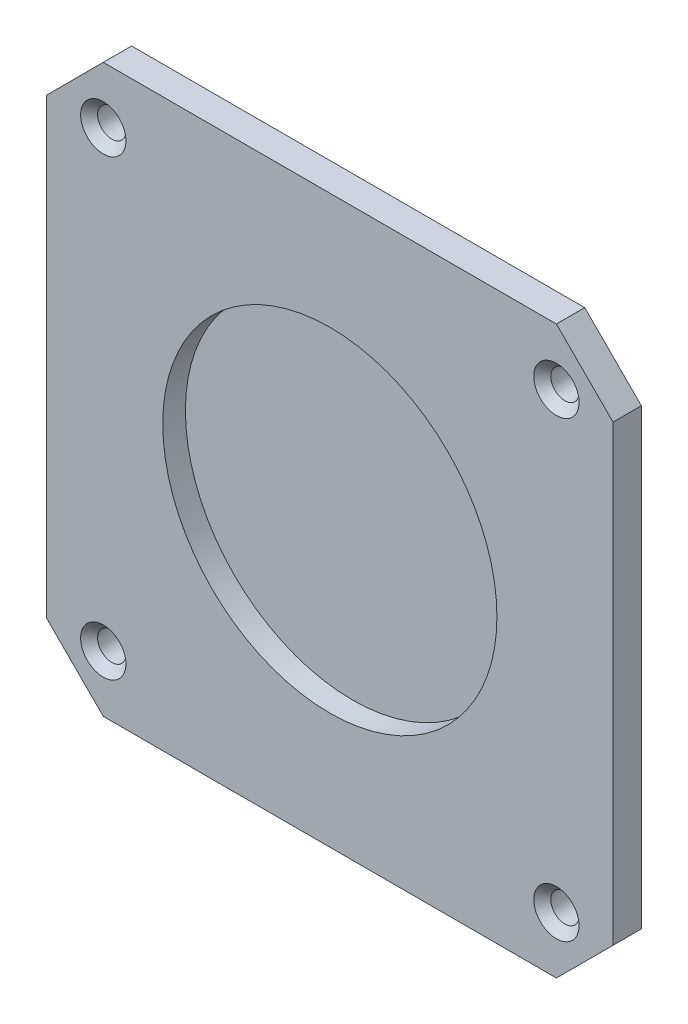
ISO-10303-21;
HEADER;
FILE_DESCRIPTION(('STEP AP214'),'2;1');
FILE_NAME('part.step','',(''),(''),'','','');
FILE_SCHEMA(('AUTOMOTIVE_DESIGN { 1 0 10303 214 1 1 1 1 }'));
ENDSEC;
DATA;
#1=APPLICATION_CONTEXT('core data for automotive mechanical design processes');
#2=APPLICATION_PROTOCOL_DEFINITION('international standard','automotive_design',2000,#1);
#3=PRODUCT_CONTEXT('',#1,'mechanical');
#4=PRODUCT('Part','Part','',(#3));
#5=PRODUCT_RELATED_PRODUCT_CATEGORY('part','',(#4));
#6=PRODUCT_DEFINITION_FORMATION('','',#4);
#7=PRODUCT_DEFINITION_CONTEXT('part definition',#1,'design');
#8=PRODUCT_DEFINITION('design','',#6,#7);
#9=PRODUCT_DEFINITION_SHAPE('','',#8);
#10=(LENGTH_UNIT() NAMED_UNIT(*) SI_UNIT(.MILLI.,.METRE.));
#11=(NAMED_UNIT(*) PLANE_ANGLE_UNIT() SI_UNIT($,.RADIAN.));
#12=(NAMED_UNIT(*) SI_UNIT($,.STERADIAN.) SOLID_ANGLE_UNIT());
#13=UNCERTAINTY_MEASURE_WITH_UNIT(LENGTH_MEASURE(1.E-05),#10,'distance_accuracy_value','');
#14=(GEOMETRIC_REPRESENTATION_CONTEXT(3) GLOBAL_UNCERTAINTY_ASSIGNED_CONTEXT((#13)) GLOBAL_UNIT_ASSIGNED_CONTEXT((#10,
#11,#12)) REPRESENTATION_CONTEXT('',''));
#15=CARTESIAN_POINT('',(0.,0.,0.));
#16=DIRECTION('',(0.,0.,1.));
#17=DIRECTION('',(1.,0.,0.));
#18=AXIS2_PLACEMENT_3D('',#15,#16,#17);
#19=CARTESIAN_POINT('',(0.,10.,5.));
#20=DIRECTION('',(0.707106781186548,0.707106781186547,0.));
#21=DIRECTION('',(-0.707106781186547,0.707106781186548,0.));
#22=AXIS2_PLACEMENT_3D('',#19,#20,#21);
#23=PLANE('',#22);
#24=DIRECTION('',(0.707106781186547,-0.707106781186548,0.));
#25=VECTOR('',#24,1.);
#26=CARTESIAN_POINT('',(0.,10.,0.));
#27=LINE('',#26,#25);
#28=CARTESIAN_POINT('',(0.,10.,0.));
#29=VERTEX_POINT('',#28);
#30=CARTESIAN_POINT('',(10.,0.,0.));
#31=VERTEX_POINT('',#30);
#32=EDGE_CURVE('E143',#29,#31,#27,.T.);
#33=ORIENTED_EDGE('',*,*,#32,.T.);
#34=DIRECTION('',(0.,0.,-1.));
#35=VECTOR('',#34,1.);
#36=CARTESIAN_POINT('',(10.,0.,5.));
#37=LINE('',#36,#35);
#38=CARTESIAN_POINT('',(10.,0.,5.));
#39=VERTEX_POINT('',#38);
#40=EDGE_CURVE('E11',#39,#31,#37,.T.);
#41=ORIENTED_EDGE('',*,*,#40,.F.);
#42=DIRECTION('',(0.707106781186547,-0.707106781186548,0.));
#43=VECTOR('',#42,1.);
#44=CARTESIAN_POINT('',(0.,10.,5.));
#45=LINE('',#44,#43);
#46=CARTESIAN_POINT('',(0.,10.,5.));
#47=VERTEX_POINT('',#46);
#48=EDGE_CURVE('E166',#47,#39,#45,.T.);
#49=ORIENTED_EDGE('',*,*,#48,.F.);
#50=DIRECTION('',(0.,0.,-1.));
#51=VECTOR('',#50,1.);
#52=CARTESIAN_POINT('',(0.,10.,5.));
#53=LINE('',#52,#51);
#54=EDGE_CURVE('E139',#47,#29,#53,.T.);
#55=ORIENTED_EDGE('',*,*,#54,.T.);
#56=EDGE_LOOP('',(#33,#41,#49,#55));
#57=FACE_BOUND('',#56,.T.);
#58=ADVANCED_FACE('F41',(#57),#23,.F.);
#59=CARTESIAN_POINT('',(10.,0.,5.));
#60=DIRECTION('',(0.,1.,0.));
#61=DIRECTION('',(0.,0.,1.));
#62=AXIS2_PLACEMENT_3D('',#59,#60,#61);
#63=PLANE('',#62);
#64=DIRECTION('',(1.,0.,0.));
#65=VECTOR('',#64,1.);
#66=CARTESIAN_POINT('',(10.,0.,0.));
#67=LINE('',#66,#65);
#68=CARTESIAN_POINT('',(90.,0.,0.));
#69=VERTEX_POINT('',#68);
#70=EDGE_CURVE('E147',#31,#69,#67,.T.);
#71=ORIENTED_EDGE('',*,*,#70,.T.);
#72=DIRECTION('',(0.,0.,-1.));
#73=VECTOR('',#72,1.);
#74=CARTESIAN_POINT('',(90.,0.,5.));
#75=LINE('',#74,#73);
#76=CARTESIAN_POINT('',(90.,0.,5.));
#77=VERTEX_POINT('',#76);
#78=EDGE_CURVE('E50',#77,#69,#75,.T.);
#79=ORIENTED_EDGE('',*,*,#78,.F.);
#80=DIRECTION('',(1.,0.,0.));
#81=VECTOR('',#80,1.);
#82=CARTESIAN_POINT('',(10.,0.,5.));
#83=LINE('',#82,#81);
#84=EDGE_CURVE('E101',#39,#77,#83,.T.);
#85=ORIENTED_EDGE('',*,*,#84,.F.);
#86=ORIENTED_EDGE('',*,*,#40,.T.);
#87=EDGE_LOOP('',(#71,#79,#85,#86));
#88=FACE_BOUND('',#87,.T.);
#89=ADVANCED_FACE('F300',(#88),#63,.F.);
#90=CARTESIAN_POINT('',(90.,0.,5.));
#91=DIRECTION('',(-0.707106781186547,0.707106781186548,0.));
#92=DIRECTION('',(-0.707106781186548,-0.707106781186547,0.));
#93=AXIS2_PLACEMENT_3D('',#90,#91,#92);
#94=PLANE('',#93);
#95=DIRECTION('',(0.707106781186548,0.707106781186547,0.));
#96=VECTOR('',#95,1.);
#97=CARTESIAN_POINT('',(90.,0.,0.));
#98=LINE('',#97,#96);
#99=CARTESIAN_POINT('',(100.,10.0000000000001,0.));
#100=VERTEX_POINT('',#99);
#101=EDGE_CURVE('E151',#69,#100,#98,.T.);
#102=ORIENTED_EDGE('',*,*,#101,.T.);
#103=DIRECTION('',(0.,0.,-1.));
#104=VECTOR('',#103,1.);
#105=CARTESIAN_POINT('',(100.,10.0000000000001,5.));
#106=LINE('',#105,#104);
#107=CARTESIAN_POINT('',(100.,10.0000000000001,5.));
#108=VERTEX_POINT('',#107);
#109=EDGE_CURVE('E177',#108,#100,#106,.T.);
#110=ORIENTED_EDGE('',*,*,#109,.F.);
#111=DIRECTION('',(0.707106781186548,0.707106781186547,0.));
#112=VECTOR('',#111,1.);
#113=CARTESIAN_POINT('',(90.,0.,5.));
#114=LINE('',#113,#112);
#115=EDGE_CURVE('E188',#77,#108,#114,.T.);
#116=ORIENTED_EDGE('',*,*,#115,.F.);
#117=ORIENTED_EDGE('',*,*,#78,.T.);
#118=EDGE_LOOP('',(#102,#110,#116,#117));
#119=FACE_BOUND('',#118,.T.);
#120=ADVANCED_FACE('F186',(#119),#94,.F.);
#121=CARTESIAN_POINT('',(100.,10.0000000000001,5.));
#122=DIRECTION('',(-1.,0.,0.));
#123=DIRECTION('',(0.,0.,1.));
#124=AXIS2_PLACEMENT_3D('',#121,#122,#123);
#125=PLANE('',#124);
#126=DIRECTION('',(0.,1.,0.));
#127=VECTOR('',#126,1.);
#128=CARTESIAN_POINT('',(100.,10.0000000000001,0.));
#129=LINE('',#128,#127);
#130=CARTESIAN_POINT('',(100.,90.0000000000001,0.));
#131=VERTEX_POINT('',#130);
#132=EDGE_CURVE('E154',#100,#131,#129,.T.);
#133=ORIENTED_EDGE('',*,*,#132,.T.);
#134=DIRECTION('',(0.,0.,-1.));
#135=VECTOR('',#134,1.);
#136=CARTESIAN_POINT('',(100.,90.0000000000001,5.));
#137=LINE('',#136,#135);
#138=CARTESIAN_POINT('',(100.,90.0000000000001,5.));
#139=VERTEX_POINT('',#138);
#140=EDGE_CURVE('E173',#139,#131,#137,.T.);
#141=ORIENTED_EDGE('',*,*,#140,.F.);
#142=DIRECTION('',(0.,1.,0.));
#143=VECTOR('',#142,1.);
#144=CARTESIAN_POINT('',(100.,10.0000000000001,5.));
#145=LINE('',#144,#143);
#146=EDGE_CURVE('E201',#108,#139,#145,.T.);
#147=ORIENTED_EDGE('',*,*,#146,.F.);
#148=ORIENTED_EDGE('',*,*,#109,.T.);
#149=EDGE_LOOP('',(#133,#141,#147,#148));
#150=FACE_BOUND('',#149,.T.);
#151=ADVANCED_FACE('F196',(#150),#125,.F.);
#152=CARTESIAN_POINT('',(100.,90.0000000000001,5.));
#153=DIRECTION('',(-0.707106781186541,-0.707106781186554,0.));
#154=DIRECTION('',(0.707106781186554,-0.707106781186541,0.));
#155=AXIS2_PLACEMENT_3D('',#152,#153,#154);
#156=PLANE('',#155);
#157=DIRECTION('',(-0.707106781186554,0.707106781186541,0.));
#158=VECTOR('',#157,1.);
#159=CARTESIAN_POINT('',(100.,90.0000000000001,0.));
#160=LINE('',#159,#158);
#161=CARTESIAN_POINT('',(90.,100.,0.));
#162=VERTEX_POINT('',#161);
#163=EDGE_CURVE('E157',#131,#162,#160,.T.);
#164=ORIENTED_EDGE('',*,*,#163,.T.);
#165=DIRECTION('',(0.,0.,-1.));
#166=VECTOR('',#165,1.);
#167=CARTESIAN_POINT('',(90.,100.,5.));
#168=LINE('',#167,#166);
#169=CARTESIAN_POINT('',(90.,100.,5.));
#170=VERTEX_POINT('',#169);
#171=EDGE_CURVE('E131',#170,#162,#168,.T.);
#172=ORIENTED_EDGE('',*,*,#171,.F.);
#173=DIRECTION('',(-0.707106781186554,0.707106781186541,0.));
#174=VECTOR('',#173,1.);
#175=CARTESIAN_POINT('',(100.,90.0000000000001,5.));
#176=LINE('',#175,#174);
#177=EDGE_CURVE('E120',#139,#170,#176,.T.);
#178=ORIENTED_EDGE('',*,*,#177,.F.);
#179=ORIENTED_EDGE('',*,*,#140,.T.);
#180=EDGE_LOOP('',(#164,#172,#178,#179));
#181=FACE_BOUND('',#180,.T.);
#182=ADVANCED_FACE('F199',(#181),#156,.F.);
#183=CARTESIAN_POINT('',(90.,100.,5.));
#184=DIRECTION('',(0.,-1.,0.));
#185=DIRECTION('',(1.,0.,0.));
#186=AXIS2_PLACEMENT_3D('',#183,#184,#185);
#187=PLANE('',#186);
#188=DIRECTION('',(-1.,0.,0.));
#189=VECTOR('',#188,1.);
#190=CARTESIAN_POINT('',(90.,100.,0.));
#191=LINE('',#190,#189);
#192=CARTESIAN_POINT('',(10.,100.,0.));
#193=VERTEX_POINT('',#192);
#194=EDGE_CURVE('E129',#162,#193,#191,.T.);
#195=ORIENTED_EDGE('',*,*,#194,.T.);
#196=DIRECTION('',(0.,0.,-1.));
#197=VECTOR('',#196,1.);
#198=CARTESIAN_POINT('',(10.,100.,5.));
#199=LINE('',#198,#197);
#200=CARTESIAN_POINT('',(10.,100.,5.));
#201=VERTEX_POINT('',#200);
#202=EDGE_CURVE('E126',#201,#193,#199,.T.);
#203=ORIENTED_EDGE('',*,*,#202,.F.);
#204=DIRECTION('',(-1.,0.,0.));
#205=VECTOR('',#204,1.);
#206=CARTESIAN_POINT('',(90.,100.,5.));
#207=LINE('',#206,#205);
#208=EDGE_CURVE('E114',#170,#201,#207,.T.);
#209=ORIENTED_EDGE('',*,*,#208,.F.);
#210=ORIENTED_EDGE('',*,*,#171,.T.);
#211=EDGE_LOOP('',(#195,#203,#209,#210));
#212=FACE_BOUND('',#211,.T.);
#213=ADVANCED_FACE('F127',(#212),#187,.F.);
#214=CARTESIAN_POINT('',(0.,90.,5.));
#215=DIRECTION('',(0.707106781186547,-0.707106781186548,0.));
#216=DIRECTION('',(0.707106781186548,0.707106781186547,0.));
#217=AXIS2_PLACEMENT_3D('',#214,#215,#216);
#218=PLANE('',#217);
#219=DIRECTION('',(-0.707106781186548,-0.707106781186547,0.));
#220=VECTOR('',#219,1.);
#221=CARTESIAN_POINT('',(0.,90.,0.));
#222=LINE('',#221,#220);
#223=CARTESIAN_POINT('',(0.,90.,0.));
#224=VERTEX_POINT('',#223);
#225=EDGE_CURVE('E87',#193,#224,#222,.T.);
#226=ORIENTED_EDGE('',*,*,#225,.T.);
#227=DIRECTION('',(0.,0.,-1.));
#228=VECTOR('',#227,1.);
#229=CARTESIAN_POINT('',(0.,90.,5.));
#230=LINE('',#229,#228);
#231=CARTESIAN_POINT('',(0.,90.,5.));
#232=VERTEX_POINT('',#231);
#233=EDGE_CURVE('E132',#232,#224,#230,.T.);
#234=ORIENTED_EDGE('',*,*,#233,.F.);
#235=DIRECTION('',(-0.707106781186548,-0.707106781186547,0.));
#236=VECTOR('',#235,1.);
#237=CARTESIAN_POINT('',(0.,90.,5.));
#238=LINE('',#237,#236);
#239=EDGE_CURVE('E118',#201,#232,#238,.T.);
#240=ORIENTED_EDGE('',*,*,#239,.F.);
#241=ORIENTED_EDGE('',*,*,#202,.T.);
#242=EDGE_LOOP('',(#226,#234,#240,#241));
#243=FACE_BOUND('',#242,.T.);
#244=ADVANCED_FACE('F134',(#243),#218,.F.);
#245=CARTESIAN_POINT('',(0.,10.,5.));
#246=DIRECTION('',(1.,0.,0.));
#247=DIRECTION('',(0.,0.,-1.));
#248=AXIS2_PLACEMENT_3D('',#245,#246,#247);
#249=PLANE('',#248);
#250=DIRECTION('',(0.,-1.,0.));
#251=VECTOR('',#250,1.);
#252=CARTESIAN_POINT('',(0.,10.,0.));
#253=LINE('',#252,#251);
#254=EDGE_CURVE('E93',#224,#29,#253,.T.);
#255=ORIENTED_EDGE('',*,*,#254,.T.);
#256=ORIENTED_EDGE('',*,*,#54,.F.);
#257=DIRECTION('',(0.,-1.,0.));
#258=VECTOR('',#257,1.);
#259=CARTESIAN_POINT('',(0.,10.,5.));
#260=LINE('',#259,#258);
#261=EDGE_CURVE('E58',#232,#47,#260,.T.);
#262=ORIENTED_EDGE('',*,*,#261,.F.);
#263=ORIENTED_EDGE('',*,*,#233,.T.);
#264=EDGE_LOOP('',(#255,#256,#262,#263));
#265=FACE_BOUND('',#264,.T.);
#266=ADVANCED_FACE('F273',(#265),#249,.F.);
#267=CARTESIAN_POINT('',(0.,0.,5.));
#268=DIRECTION('',(0.,0.,1.));
#269=DIRECTION('',(1.,0.,0.));
#270=AXIS2_PLACEMENT_3D('',#267,#268,#269);
#271=PLANE('',#270);
#272=CARTESIAN_POINT('',(10.,90.,5.));
#273=DIRECTION('',(0.,0.,1.));
#274=DIRECTION('',(1.,0.,0.));
#275=AXIS2_PLACEMENT_3D('',#272,#273,#274);
#276=CIRCLE('',#275,4.);
#277=CARTESIAN_POINT('',(14.,90.,5.));
#278=VERTEX_POINT('',#277);
#279=EDGE_CURVE('E263',#278,#278,#276,.T.);
#280=ORIENTED_EDGE('',*,*,#279,.F.);
#281=EDGE_LOOP('',(#280));
#282=FACE_BOUND('',#281,.T.);
#283=CARTESIAN_POINT('',(10.,10.,5.));
#284=DIRECTION('',(0.,0.,1.));
#285=DIRECTION('',(1.,0.,0.));
#286=AXIS2_PLACEMENT_3D('',#283,#284,#285);
#287=CIRCLE('',#286,4.);
#288=CARTESIAN_POINT('',(14.,10.,5.));
#289=VERTEX_POINT('',#288);
#290=EDGE_CURVE('E251',#289,#289,#287,.T.);
#291=ORIENTED_EDGE('',*,*,#290,.F.);
#292=EDGE_LOOP('',(#291));
#293=FACE_BOUND('',#292,.T.);
#294=CARTESIAN_POINT('',(90.,10.0000000000001,5.));
#295=DIRECTION('',(0.,0.,1.));
#296=DIRECTION('',(1.,0.,0.));
#297=AXIS2_PLACEMENT_3D('',#294,#295,#296);
#298=CIRCLE('',#297,4.);
#299=CARTESIAN_POINT('',(94.,10.0000000000001,5.));
#300=VERTEX_POINT('',#299);
#301=EDGE_CURVE('E239',#300,#300,#298,.T.);
#302=ORIENTED_EDGE('',*,*,#301,.F.);
#303=EDGE_LOOP('',(#302));
#304=FACE_BOUND('',#303,.T.);
#305=CARTESIAN_POINT('',(90.,90.0000000000001,5.));
#306=DIRECTION('',(0.,0.,1.));
#307=DIRECTION('',(1.,0.,0.));
#308=AXIS2_PLACEMENT_3D('',#305,#306,#307);
#309=CIRCLE('',#308,4.);
#310=CARTESIAN_POINT('',(94.,90.0000000000001,5.));
#311=VERTEX_POINT('',#310);
#312=EDGE_CURVE('E227',#311,#311,#309,.T.);
#313=ORIENTED_EDGE('',*,*,#312,.F.);
#314=EDGE_LOOP('',(#313));
#315=FACE_BOUND('',#314,.T.);
#316=CARTESIAN_POINT('',(50.,50.,5.));
#317=DIRECTION('',(0.,0.,1.));
#318=DIRECTION('',(1.,0.,0.));
#319=AXIS2_PLACEMENT_3D('',#316,#317,#318);
#320=CIRCLE('',#319,29.5);
#321=CARTESIAN_POINT('',(79.5,50.,5.));
#322=VERTEX_POINT('',#321);
#323=EDGE_CURVE('E212',#322,#322,#320,.T.);
#324=ORIENTED_EDGE('',*,*,#323,.F.);
#325=EDGE_LOOP('',(#324));
#326=FACE_BOUND('',#325,.T.);
#327=ORIENTED_EDGE('',*,*,#48,.T.);
#328=ORIENTED_EDGE('',*,*,#84,.T.);
#329=ORIENTED_EDGE('',*,*,#115,.T.);
#330=ORIENTED_EDGE('',*,*,#146,.T.);
#331=ORIENTED_EDGE('',*,*,#177,.T.);
#332=ORIENTED_EDGE('',*,*,#208,.T.);
#333=ORIENTED_EDGE('',*,*,#239,.T.);
#334=ORIENTED_EDGE('',*,*,#261,.T.);
#335=EDGE_LOOP('',(#327,#328,#329,#330,#331,#332,#333,#334));
#336=FACE_BOUND('',#335,.T.);
#337=ADVANCED_FACE('F116',(#282,#293,#304,#315,#326,#336),#271,.T.);
#338=CARTESIAN_POINT('',(0.,0.,0.));
#339=DIRECTION('',(0.,0.,1.));
#340=DIRECTION('',(1.,0.,0.));
#341=AXIS2_PLACEMENT_3D('',#338,#339,#340);
#342=PLANE('',#341);
#343=CARTESIAN_POINT('',(10.,90.,0.));
#344=DIRECTION('',(0.,0.,1.));
#345=DIRECTION('',(1.,0.,0.));
#346=AXIS2_PLACEMENT_3D('',#343,#344,#345);
#347=CIRCLE('',#346,2.5);
#348=CARTESIAN_POINT('',(12.5,90.,0.));
#349=VERTEX_POINT('',#348);
#350=EDGE_CURVE('E255',#349,#349,#347,.T.);
#351=ORIENTED_EDGE('',*,*,#350,.T.);
#352=EDGE_LOOP('',(#351));
#353=FACE_BOUND('',#352,.T.);
#354=CARTESIAN_POINT('',(10.,10.,0.));
#355=DIRECTION('',(0.,0.,1.));
#356=DIRECTION('',(1.,0.,0.));
#357=AXIS2_PLACEMENT_3D('',#354,#355,#356);
#358=CIRCLE('',#357,2.5);
#359=CARTESIAN_POINT('',(12.5,10.,0.));
#360=VERTEX_POINT('',#359);
#361=EDGE_CURVE('E243',#360,#360,#358,.T.);
#362=ORIENTED_EDGE('',*,*,#361,.T.);
#363=EDGE_LOOP('',(#362));
#364=FACE_BOUND('',#363,.T.);
#365=CARTESIAN_POINT('',(90.,10.0000000000001,0.));
#366=DIRECTION('',(0.,0.,1.));
#367=DIRECTION('',(1.,0.,0.));
#368=AXIS2_PLACEMENT_3D('',#365,#366,#367);
#369=CIRCLE('',#368,2.5);
#370=CARTESIAN_POINT('',(92.5,10.0000000000001,0.));
#371=VERTEX_POINT('',#370);
#372=EDGE_CURVE('E231',#371,#371,#369,.T.);
#373=ORIENTED_EDGE('',*,*,#372,.T.);
#374=EDGE_LOOP('',(#373));
#375=FACE_BOUND('',#374,.T.);
#376=CARTESIAN_POINT('',(90.,90.0000000000001,0.));
#377=DIRECTION('',(0.,0.,1.));
#378=DIRECTION('',(1.,0.,0.));
#379=AXIS2_PLACEMENT_3D('',#376,#377,#378);
#380=CIRCLE('',#379,2.5);
#381=CARTESIAN_POINT('',(92.5,90.0000000000001,0.));
#382=VERTEX_POINT('',#381);
#383=EDGE_CURVE('E216',#382,#382,#380,.T.);
#384=ORIENTED_EDGE('',*,*,#383,.T.);
#385=EDGE_LOOP('',(#384));
#386=FACE_BOUND('',#385,.T.);
#387=ORIENTED_EDGE('',*,*,#32,.F.);
#388=ORIENTED_EDGE('',*,*,#254,.F.);
#389=ORIENTED_EDGE('',*,*,#225,.F.);
#390=ORIENTED_EDGE('',*,*,#194,.F.);
#391=ORIENTED_EDGE('',*,*,#163,.F.);
#392=ORIENTED_EDGE('',*,*,#132,.F.);
#393=ORIENTED_EDGE('',*,*,#101,.F.);
#394=ORIENTED_EDGE('',*,*,#70,.F.);
#395=EDGE_LOOP('',(#387,#388,#389,#390,#391,#392,#393,#394));
#396=FACE_BOUND('',#395,.T.);
#397=ADVANCED_FACE('F192',(#353,#364,#375,#386,#396),#342,.F.);
#398=CARTESIAN_POINT('',(50.,50.,1.));
#399=DIRECTION('',(0.,0.,1.));
#400=DIRECTION('',(1.,0.,0.));
#401=AXIS2_PLACEMENT_3D('',#398,#399,#400);
#402=CYLINDRICAL_SURFACE('',#401,29.5);
#403=CARTESIAN_POINT('',(50.,50.,1.));
#404=DIRECTION('',(0.,0.,1.));
#405=DIRECTION('',(1.,0.,0.));
#406=AXIS2_PLACEMENT_3D('',#403,#404,#405);
#407=CIRCLE('',#406,29.5);
#408=CARTESIAN_POINT('',(79.5,50.,1.));
#409=VERTEX_POINT('',#408);
#410=EDGE_CURVE('E148',#409,#409,#407,.T.);
#411=ORIENTED_EDGE('',*,*,#410,.F.);
#412=EDGE_LOOP('',(#411));
#413=FACE_BOUND('',#412,.T.);
#414=ORIENTED_EDGE('',*,*,#323,.T.);
#415=EDGE_LOOP('',(#414));
#416=FACE_BOUND('',#415,.T.);
#417=ADVANCED_FACE('F283',(#413,#416),#402,.F.);
#418=CARTESIAN_POINT('',(50.,50.,1.));
#419=DIRECTION('',(0.,0.,1.));
#420=DIRECTION('',(1.,0.,0.));
#421=AXIS2_PLACEMENT_3D('',#418,#419,#420);
#422=PLANE('',#421);
#423=ORIENTED_EDGE('',*,*,#410,.T.);
#424=EDGE_LOOP('',(#423));
#425=FACE_BOUND('',#424,.T.);
#426=ADVANCED_FACE('F285',(#425),#422,.T.);
#427=CARTESIAN_POINT('',(90.,90.0000000000001,5.));
#428=DIRECTION('',(0.,0.,1.));
#429=DIRECTION('',(1.,0.,0.));
#430=AXIS2_PLACEMENT_3D('',#427,#428,#429);
#431=CYLINDRICAL_SURFACE('',#430,2.5);
#432=ORIENTED_EDGE('',*,*,#383,.F.);
#433=EDGE_LOOP('',(#432));
#434=FACE_BOUND('',#433,.T.);
#435=CARTESIAN_POINT('',(90.,90.0000000000001,3.5));
#436=DIRECTION('',(0.,0.,1.));
#437=DIRECTION('',(1.,0.,0.));
#438=AXIS2_PLACEMENT_3D('',#435,#436,#437);
#439=CIRCLE('',#438,2.5);
#440=CARTESIAN_POINT('',(92.5,90.0000000000001,3.5));
#441=VERTEX_POINT('',#440);
#442=EDGE_CURVE('E223',#441,#441,#439,.T.);
#443=ORIENTED_EDGE('',*,*,#442,.T.);
#444=EDGE_LOOP('',(#443));
#445=FACE_BOUND('',#444,.T.);
#446=ADVANCED_FACE('F292',(#434,#445),#431,.F.);
#447=CARTESIAN_POINT('',(90.,90.0000000000001,5.));
#448=DIRECTION('',(0.,0.,1.));
#449=DIRECTION('',(1.,0.,0.));
#450=AXIS2_PLACEMENT_3D('',#447,#448,#449);
#451=CONICAL_SURFACE('',#450,4.,0.785398163397449);
#452=ORIENTED_EDGE('',*,*,#442,.F.);
#453=EDGE_LOOP('',(#452));
#454=FACE_BOUND('',#453,.T.);
#455=ORIENTED_EDGE('',*,*,#312,.T.);
#456=EDGE_LOOP('',(#455));
#457=FACE_BOUND('',#456,.T.);
#458=ADVANCED_FACE('F380',(#454,#457),#451,.F.);
#459=CARTESIAN_POINT('',(90.,10.0000000000001,5.));
#460=DIRECTION('',(0.,0.,1.));
#461=DIRECTION('',(1.,0.,0.));
#462=AXIS2_PLACEMENT_3D('',#459,#460,#461);
#463=CYLINDRICAL_SURFACE('',#462,2.5);
#464=ORIENTED_EDGE('',*,*,#372,.F.);
#465=EDGE_LOOP('',(#464));
#466=FACE_BOUND('',#465,.T.);
#467=CARTESIAN_POINT('',(90.,10.0000000000001,3.5));
#468=DIRECTION('',(0.,0.,1.));
#469=DIRECTION('',(1.,0.,0.));
#470=AXIS2_PLACEMENT_3D('',#467,#468,#469);
#471=CIRCLE('',#470,2.5);
#472=CARTESIAN_POINT('',(92.5,10.0000000000001,3.5));
#473=VERTEX_POINT('',#472);
#474=EDGE_CURVE('E235',#473,#473,#471,.T.);
#475=ORIENTED_EDGE('',*,*,#474,.T.);
#476=EDGE_LOOP('',(#475));
#477=FACE_BOUND('',#476,.T.);
#478=ADVANCED_FACE('F390',(#466,#477),#463,.F.);
#479=CARTESIAN_POINT('',(90.,10.0000000000001,5.));
#480=DIRECTION('',(0.,0.,1.));
#481=DIRECTION('',(1.,0.,0.));
#482=AXIS2_PLACEMENT_3D('',#479,#480,#481);
#483=CONICAL_SURFACE('',#482,4.,0.785398163397449);
#484=ORIENTED_EDGE('',*,*,#474,.F.);
#485=EDGE_LOOP('',(#484));
#486=FACE_BOUND('',#485,.T.);
#487=ORIENTED_EDGE('',*,*,#301,.T.);
#488=EDGE_LOOP('',(#487));
#489=FACE_BOUND('',#488,.T.);
#490=ADVANCED_FACE('F400',(#486,#489),#483,.F.);
#491=CARTESIAN_POINT('',(10.,10.,5.));
#492=DIRECTION('',(0.,0.,1.));
#493=DIRECTION('',(1.,0.,0.));
#494=AXIS2_PLACEMENT_3D('',#491,#492,#493);
#495=CYLINDRICAL_SURFACE('',#494,2.5);
#496=ORIENTED_EDGE('',*,*,#361,.F.);
#497=EDGE_LOOP('',(#496));
#498=FACE_BOUND('',#497,.T.);
#499=CARTESIAN_POINT('',(10.,10.,3.5));
#500=DIRECTION('',(0.,0.,1.));
#501=DIRECTION('',(1.,0.,0.));
#502=AXIS2_PLACEMENT_3D('',#499,#500,#501);
#503=CIRCLE('',#502,2.5);
#504=CARTESIAN_POINT('',(12.5,10.,3.5));
#505=VERTEX_POINT('',#504);
#506=EDGE_CURVE('E247',#505,#505,#503,.T.);
#507=ORIENTED_EDGE('',*,*,#506,.T.);
#508=EDGE_LOOP('',(#507));
#509=FACE_BOUND('',#508,.T.);
#510=ADVANCED_FACE('F410',(#498,#509),#495,.F.);
#511=CARTESIAN_POINT('',(10.,10.,5.));
#512=DIRECTION('',(0.,0.,1.));
#513=DIRECTION('',(1.,0.,0.));
#514=AXIS2_PLACEMENT_3D('',#511,#512,#513);
#515=CONICAL_SURFACE('',#514,4.,0.785398163397449);
#516=ORIENTED_EDGE('',*,*,#506,.F.);
#517=EDGE_LOOP('',(#516));
#518=FACE_BOUND('',#517,.T.);
#519=ORIENTED_EDGE('',*,*,#290,.T.);
#520=EDGE_LOOP('',(#519));
#521=FACE_BOUND('',#520,.T.);
#522=ADVANCED_FACE('F420',(#518,#521),#515,.F.);
#523=CARTESIAN_POINT('',(10.,90.,5.));
#524=DIRECTION('',(0.,0.,1.));
#525=DIRECTION('',(1.,0.,0.));
#526=AXIS2_PLACEMENT_3D('',#523,#524,#525);
#527=CYLINDRICAL_SURFACE('',#526,2.5);
#528=ORIENTED_EDGE('',*,*,#350,.F.);
#529=EDGE_LOOP('',(#528));
#530=FACE_BOUND('',#529,.T.);
#531=CARTESIAN_POINT('',(10.,90.,3.5));
#532=DIRECTION('',(0.,0.,1.));
#533=DIRECTION('',(1.,0.,0.));
#534=AXIS2_PLACEMENT_3D('',#531,#532,#533);
#535=CIRCLE('',#534,2.5);
#536=CARTESIAN_POINT('',(12.5,90.,3.5));
#537=VERTEX_POINT('',#536);
#538=EDGE_CURVE('E259',#537,#537,#535,.T.);
#539=ORIENTED_EDGE('',*,*,#538,.T.);
#540=EDGE_LOOP('',(#539));
#541=FACE_BOUND('',#540,.T.);
#542=ADVANCED_FACE('F430',(#530,#541),#527,.F.);
#543=CARTESIAN_POINT('',(10.,90.,5.));
#544=DIRECTION('',(0.,0.,1.));
#545=DIRECTION('',(1.,0.,0.));
#546=AXIS2_PLACEMENT_3D('',#543,#544,#545);
#547=CONICAL_SURFACE('',#546,4.,0.785398163397449);
#548=ORIENTED_EDGE('',*,*,#538,.F.);
#549=EDGE_LOOP('',(#548));
#550=FACE_BOUND('',#549,.T.);
#551=ORIENTED_EDGE('',*,*,#279,.T.);
#552=EDGE_LOOP('',(#551));
#553=FACE_BOUND('',#552,.T.);
#554=ADVANCED_FACE('F269',(#550,#553),#547,.F.);
#555=CLOSED_SHELL('',(#58,#89,#120,#151,#182,#213,#244,#266,#337,#397,#417,#426,#446,#458,#478,
#490,#510,#522,#542,#554));
#556=MANIFOLD_SOLID_BREP('B2',#555);
#557=ADVANCED_BREP_SHAPE_REPRESENTATION('',(#18,#556),#14);
#558=SHAPE_DEFINITION_REPRESENTATION(#9,#557);
ENDSEC;
END-ISO-10303-21;
